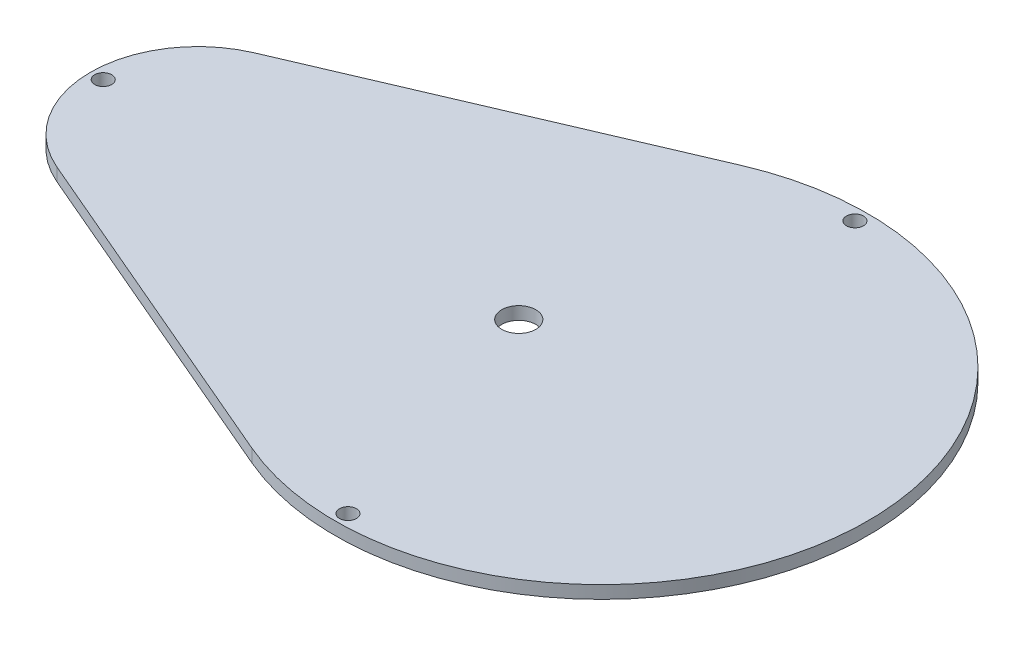
ISO-10303-21;
HEADER;
FILE_DESCRIPTION(('STEP AP214'),'2;1');
FILE_NAME('part.step','',(''),(''),'','','');
FILE_SCHEMA(('AUTOMOTIVE_DESIGN { 1 0 10303 214 1 1 1 1 }'));
ENDSEC;
DATA;
#1=APPLICATION_CONTEXT('core data for automotive mechanical design processes');
#2=APPLICATION_PROTOCOL_DEFINITION('international standard','automotive_design',2000,#1);
#3=PRODUCT_CONTEXT('',#1,'mechanical');
#4=PRODUCT('Part','Part','',(#3));
#5=PRODUCT_RELATED_PRODUCT_CATEGORY('part','',(#4));
#6=PRODUCT_DEFINITION_FORMATION('','',#4);
#7=PRODUCT_DEFINITION_CONTEXT('part definition',#1,'design');
#8=PRODUCT_DEFINITION('design','',#6,#7);
#9=PRODUCT_DEFINITION_SHAPE('','',#8);
#10=(LENGTH_UNIT() NAMED_UNIT(*) SI_UNIT(.MILLI.,.METRE.));
#11=(NAMED_UNIT(*) PLANE_ANGLE_UNIT() SI_UNIT($,.RADIAN.));
#12=(NAMED_UNIT(*) SI_UNIT($,.STERADIAN.) SOLID_ANGLE_UNIT());
#13=UNCERTAINTY_MEASURE_WITH_UNIT(LENGTH_MEASURE(1.E-05),#10,'distance_accuracy_value','');
#14=(GEOMETRIC_REPRESENTATION_CONTEXT(3) GLOBAL_UNCERTAINTY_ASSIGNED_CONTEXT((#13)) GLOBAL_UNIT_ASSIGNED_CONTEXT((#10,
#11,#12)) REPRESENTATION_CONTEXT('',''));
#15=CARTESIAN_POINT('',(0.,0.,0.));
#16=DIRECTION('',(0.,0.,1.));
#17=DIRECTION('',(1.,0.,0.));
#18=AXIS2_PLACEMENT_3D('',#15,#16,#17);
#19=CARTESIAN_POINT('',(0.,3.,0.));
#20=DIRECTION('',(0.,-1.,0.));
#21=DIRECTION('',(0.,0.,-1.));
#22=AXIS2_PLACEMENT_3D('',#19,#20,#21);
#23=CYLINDRICAL_SURFACE('',#22,62.5);
#24=CARTESIAN_POINT('',(0.,0.,0.));
#25=DIRECTION('',(0.,1.,0.));
#26=DIRECTION('',(0.,0.,1.));
#27=AXIS2_PLACEMENT_3D('',#24,#25,#26);
#28=CIRCLE('',#27,62.5);
#29=CARTESIAN_POINT('',(-24.5986851027459,0.,57.4556758833794));
#30=VERTEX_POINT('',#29);
#31=CARTESIAN_POINT('',(-24.5986851027459,0.,-57.4556758833794));
#32=VERTEX_POINT('',#31);
#33=EDGE_CURVE('E99',#30,#32,#28,.T.);
#34=ORIENTED_EDGE('',*,*,#33,.T.);
#35=DIRECTION('',(0.,-1.,0.));
#36=VECTOR('',#35,1.);
#37=CARTESIAN_POINT('',(-24.5986851027459,3.,-57.4556758833794));
#38=LINE('',#37,#36);
#39=CARTESIAN_POINT('',(-24.5986851027459,3.,-57.4556758833794));
#40=VERTEX_POINT('',#39);
#41=EDGE_CURVE('E11',#40,#32,#38,.T.);
#42=ORIENTED_EDGE('',*,*,#41,.F.);
#43=CARTESIAN_POINT('',(0.,3.,0.));
#44=DIRECTION('',(0.,1.,0.));
#45=DIRECTION('',(0.,0.,1.));
#46=AXIS2_PLACEMENT_3D('',#43,#44,#45);
#47=CIRCLE('',#46,62.5);
#48=CARTESIAN_POINT('',(-24.5986851027459,3.,57.4556758833794));
#49=VERTEX_POINT('',#48);
#50=EDGE_CURVE('E86',#49,#40,#47,.T.);
#51=ORIENTED_EDGE('',*,*,#50,.F.);
#52=DIRECTION('',(0.,-1.,0.));
#53=VECTOR('',#52,1.);
#54=CARTESIAN_POINT('',(-24.5986851027459,3.,57.4556758833794));
#55=LINE('',#54,#53);
#56=EDGE_CURVE('E95',#49,#30,#55,.T.);
#57=ORIENTED_EDGE('',*,*,#56,.T.);
#58=EDGE_LOOP('',(#34,#42,#51,#57));
#59=FACE_BOUND('',#58,.T.);
#60=ADVANCED_FACE('F33',(#59),#23,.T.);
#61=CARTESIAN_POINT('',(-104.654394699777,3.,-23.1811649533998));
#62=DIRECTION('',(0.393578961643935,0.,0.91929081413407));
#63=DIRECTION('',(0.919290814134071,0.,-0.393578961643935));
#64=AXIS2_PLACEMENT_3D('',#61,#62,#63);
#65=PLANE('',#64);
#66=DIRECTION('',(-0.919290814134071,0.,0.393578961643935));
#67=VECTOR('',#66,1.);
#68=CARTESIAN_POINT('',(-104.654394699777,0.,-23.1811649533998));
#69=LINE('',#68,#67);
#70=CARTESIAN_POINT('',(-104.654394699777,0.,-23.1811649533998));
#71=VERTEX_POINT('',#70);
#72=EDGE_CURVE('E90',#32,#71,#69,.T.);
#73=ORIENTED_EDGE('',*,*,#72,.T.);
#74=DIRECTION('',(0.,-1.,0.));
#75=VECTOR('',#74,1.);
#76=CARTESIAN_POINT('',(-104.654394699777,3.,-23.1811649533998));
#77=LINE('',#76,#75);
#78=CARTESIAN_POINT('',(-104.654394699777,3.,-23.1811649533998));
#79=VERTEX_POINT('',#78);
#80=EDGE_CURVE('E42',#79,#71,#77,.T.);
#81=ORIENTED_EDGE('',*,*,#80,.F.);
#82=DIRECTION('',(-0.919290814134071,0.,0.393578961643935));
#83=VECTOR('',#82,1.);
#84=CARTESIAN_POINT('',(-104.654394699777,3.,-23.1811649533998));
#85=LINE('',#84,#83);
#86=EDGE_CURVE('E81',#40,#79,#85,.T.);
#87=ORIENTED_EDGE('',*,*,#86,.F.);
#88=ORIENTED_EDGE('',*,*,#41,.T.);
#89=EDGE_LOOP('',(#73,#81,#87,#88));
#90=FACE_BOUND('',#89,.T.);
#91=ADVANCED_FACE('F89',(#90),#65,.F.);
#92=CARTESIAN_POINT('',(-94.729767267652,3.,0.));
#93=DIRECTION('',(0.,-1.,0.));
#94=DIRECTION('',(0.,0.,-1.));
#95=AXIS2_PLACEMENT_3D('',#92,#93,#94);
#96=CYLINDRICAL_SURFACE('',#95,25.2163565620259);
#97=CARTESIAN_POINT('',(-94.729767267652,0.,0.));
#98=DIRECTION('',(0.,1.,0.));
#99=DIRECTION('',(0.,0.,1.));
#100=AXIS2_PLACEMENT_3D('',#97,#98,#99);
#101=CIRCLE('',#100,25.2163565620259);
#102=CARTESIAN_POINT('',(-104.654394699777,0.,23.1811649533998));
#103=VERTEX_POINT('',#102);
#104=EDGE_CURVE('E68',#71,#103,#101,.T.);
#105=ORIENTED_EDGE('',*,*,#104,.T.);
#106=DIRECTION('',(0.,-1.,0.));
#107=VECTOR('',#106,1.);
#108=CARTESIAN_POINT('',(-104.654394699777,3.,23.1811649533998));
#109=LINE('',#108,#107);
#110=CARTESIAN_POINT('',(-104.654394699777,3.,23.1811649533998));
#111=VERTEX_POINT('',#110);
#112=EDGE_CURVE('E91',#111,#103,#109,.T.);
#113=ORIENTED_EDGE('',*,*,#112,.F.);
#114=CARTESIAN_POINT('',(-94.729767267652,3.,0.));
#115=DIRECTION('',(0.,1.,0.));
#116=DIRECTION('',(0.,0.,1.));
#117=AXIS2_PLACEMENT_3D('',#114,#115,#116);
#118=CIRCLE('',#117,25.2163565620259);
#119=EDGE_CURVE('E84',#79,#111,#118,.T.);
#120=ORIENTED_EDGE('',*,*,#119,.F.);
#121=ORIENTED_EDGE('',*,*,#80,.T.);
#122=EDGE_LOOP('',(#105,#113,#120,#121));
#123=FACE_BOUND('',#122,.T.);
#124=ADVANCED_FACE('F93',(#123),#96,.T.);
#125=CARTESIAN_POINT('',(-104.654394699777,3.,23.1811649533998));
#126=DIRECTION('',(0.393578961643935,0.,-0.919290814134071));
#127=DIRECTION('',(-0.919290814134071,0.,-0.393578961643935));
#128=AXIS2_PLACEMENT_3D('',#125,#126,#127);
#129=PLANE('',#128);
#130=DIRECTION('',(0.919290814134071,0.,0.393578961643935));
#131=VECTOR('',#130,1.);
#132=CARTESIAN_POINT('',(-104.654394699777,0.,23.1811649533998));
#133=LINE('',#132,#131);
#134=EDGE_CURVE('E74',#103,#30,#133,.T.);
#135=ORIENTED_EDGE('',*,*,#134,.T.);
#136=ORIENTED_EDGE('',*,*,#56,.F.);
#137=DIRECTION('',(0.919290814134071,0.,0.393578961643935));
#138=VECTOR('',#137,1.);
#139=CARTESIAN_POINT('',(-104.654394699777,3.,23.1811649533998));
#140=LINE('',#139,#138);
#141=EDGE_CURVE('E51',#111,#49,#140,.T.);
#142=ORIENTED_EDGE('',*,*,#141,.F.);
#143=ORIENTED_EDGE('',*,*,#112,.T.);
#144=EDGE_LOOP('',(#135,#136,#142,#143));
#145=FACE_BOUND('',#144,.T.);
#146=ADVANCED_FACE('F138',(#145),#129,.F.);
#147=CARTESIAN_POINT('',(0.,3.,0.));
#148=DIRECTION('',(0.,1.,0.));
#149=DIRECTION('',(0.,0.,1.));
#150=AXIS2_PLACEMENT_3D('',#147,#148,#149);
#151=PLANE('',#150);
#152=CARTESIAN_POINT('',(6.23241725801248E-13,3.,59.5));
#153=DIRECTION('',(0.,1.,0.));
#154=DIRECTION('',(0.,0.,1.));
#155=AXIS2_PLACEMENT_3D('',#152,#153,#154);
#156=CIRCLE('',#155,2.);
#157=CARTESIAN_POINT('',(6.23241725801248E-13,3.,61.5));
#158=VERTEX_POINT('',#157);
#159=EDGE_CURVE('E116',#158,#158,#156,.T.);
#160=ORIENTED_EDGE('',*,*,#159,.F.);
#161=EDGE_LOOP('',(#160));
#162=FACE_BOUND('',#161,.T.);
#163=CARTESIAN_POINT('',(0.,3.,-59.5));
#164=DIRECTION('',(0.,1.,0.));
#165=DIRECTION('',(0.,0.,1.));
#166=AXIS2_PLACEMENT_3D('',#163,#164,#165);
#167=CIRCLE('',#166,2.);
#168=CARTESIAN_POINT('',(0.,3.,-57.5));
#169=VERTEX_POINT('',#168);
#170=EDGE_CURVE('E121',#169,#169,#167,.T.);
#171=ORIENTED_EDGE('',*,*,#170,.F.);
#172=EDGE_LOOP('',(#171));
#173=FACE_BOUND('',#172,.T.);
#174=CARTESIAN_POINT('',(-116.946123829678,3.,0.));
#175=DIRECTION('',(0.,1.,0.));
#176=DIRECTION('',(0.,0.,1.));
#177=AXIS2_PLACEMENT_3D('',#174,#175,#176);
#178=CIRCLE('',#177,2.);
#179=CARTESIAN_POINT('',(-116.946123829678,3.,2.));
#180=VERTEX_POINT('',#179);
#181=EDGE_CURVE('E113',#180,#180,#178,.T.);
#182=ORIENTED_EDGE('',*,*,#181,.F.);
#183=EDGE_LOOP('',(#182));
#184=FACE_BOUND('',#183,.T.);
#185=CARTESIAN_POINT('',(-19.4028517241458,3.,0.));
#186=DIRECTION('',(0.,1.,0.));
#187=DIRECTION('',(0.,0.,1.));
#188=AXIS2_PLACEMENT_3D('',#185,#186,#187);
#189=CIRCLE('',#188,4.);
#190=CARTESIAN_POINT('',(-19.4028517241458,3.,3.99999999999999));
#191=VERTEX_POINT('',#190);
#192=EDGE_CURVE('E110',#191,#191,#189,.T.);
#193=ORIENTED_EDGE('',*,*,#192,.F.);
#194=EDGE_LOOP('',(#193));
#195=FACE_BOUND('',#194,.T.);
#196=ORIENTED_EDGE('',*,*,#50,.T.);
#197=ORIENTED_EDGE('',*,*,#86,.T.);
#198=ORIENTED_EDGE('',*,*,#119,.T.);
#199=ORIENTED_EDGE('',*,*,#141,.T.);
#200=EDGE_LOOP('',(#196,#197,#198,#199));
#201=FACE_BOUND('',#200,.T.);
#202=ADVANCED_FACE('F82',(#162,#173,#184,#195,#201),#151,.T.);
#203=CARTESIAN_POINT('',(0.,0.,0.));
#204=DIRECTION('',(0.,1.,0.));
#205=DIRECTION('',(0.,0.,1.));
#206=AXIS2_PLACEMENT_3D('',#203,#204,#205);
#207=PLANE('',#206);
#208=CARTESIAN_POINT('',(6.23241725801248E-13,0.,59.5));
#209=DIRECTION('',(0.,1.,0.));
#210=DIRECTION('',(0.,0.,1.));
#211=AXIS2_PLACEMENT_3D('',#208,#209,#210);
#212=CIRCLE('',#211,2.);
#213=CARTESIAN_POINT('',(6.23241725801248E-13,0.,61.5));
#214=VERTEX_POINT('',#213);
#215=EDGE_CURVE('E36',#214,#214,#212,.T.);
#216=ORIENTED_EDGE('',*,*,#215,.T.);
#217=EDGE_LOOP('',(#216));
#218=FACE_BOUND('',#217,.T.);
#219=CARTESIAN_POINT('',(0.,0.,-59.5));
#220=DIRECTION('',(0.,1.,0.));
#221=DIRECTION('',(0.,0.,1.));
#222=AXIS2_PLACEMENT_3D('',#219,#220,#221);
#223=CIRCLE('',#222,2.);
#224=CARTESIAN_POINT('',(0.,0.,-57.5));
#225=VERTEX_POINT('',#224);
#226=EDGE_CURVE('E114',#225,#225,#223,.T.);
#227=ORIENTED_EDGE('',*,*,#226,.T.);
#228=EDGE_LOOP('',(#227));
#229=FACE_BOUND('',#228,.T.);
#230=CARTESIAN_POINT('',(-116.946123829678,0.,0.));
#231=DIRECTION('',(0.,1.,0.));
#232=DIRECTION('',(0.,0.,1.));
#233=AXIS2_PLACEMENT_3D('',#230,#231,#232);
#234=CIRCLE('',#233,2.);
#235=CARTESIAN_POINT('',(-116.946123829678,0.,2.));
#236=VERTEX_POINT('',#235);
#237=EDGE_CURVE('E111',#236,#236,#234,.T.);
#238=ORIENTED_EDGE('',*,*,#237,.T.);
#239=EDGE_LOOP('',(#238));
#240=FACE_BOUND('',#239,.T.);
#241=CARTESIAN_POINT('',(-19.4028517241458,0.,0.));
#242=DIRECTION('',(0.,1.,0.));
#243=DIRECTION('',(0.,0.,1.));
#244=AXIS2_PLACEMENT_3D('',#241,#242,#243);
#245=CIRCLE('',#244,4.);
#246=CARTESIAN_POINT('',(-19.4028517241458,0.,3.99999999999999));
#247=VERTEX_POINT('',#246);
#248=EDGE_CURVE('E102',#247,#247,#245,.T.);
#249=ORIENTED_EDGE('',*,*,#248,.T.);
#250=EDGE_LOOP('',(#249));
#251=FACE_BOUND('',#250,.T.);
#252=ORIENTED_EDGE('',*,*,#33,.F.);
#253=ORIENTED_EDGE('',*,*,#134,.F.);
#254=ORIENTED_EDGE('',*,*,#104,.F.);
#255=ORIENTED_EDGE('',*,*,#72,.F.);
#256=EDGE_LOOP('',(#252,#253,#254,#255));
#257=FACE_BOUND('',#256,.T.);
#258=ADVANCED_FACE('F137',(#218,#229,#240,#251,#257),#207,.F.);
#259=CARTESIAN_POINT('',(-19.4028517241458,-4.99999999999999,0.));
#260=DIRECTION('',(0.,1.,0.));
#261=DIRECTION('',(0.,0.,1.));
#262=AXIS2_PLACEMENT_3D('',#259,#260,#261);
#263=CYLINDRICAL_SURFACE('',#262,4.);
#264=ORIENTED_EDGE('',*,*,#192,.T.);
#265=EDGE_LOOP('',(#264));
#266=FACE_BOUND('',#265,.T.);
#267=ORIENTED_EDGE('',*,*,#248,.F.);
#268=EDGE_LOOP('',(#267));
#269=FACE_BOUND('',#268,.T.);
#270=ADVANCED_FACE('F133',(#266,#269),#263,.F.);
#271=CARTESIAN_POINT('',(-116.946123829678,-7.,0.));
#272=DIRECTION('',(0.,1.,0.));
#273=DIRECTION('',(0.,0.,1.));
#274=AXIS2_PLACEMENT_3D('',#271,#272,#273);
#275=CYLINDRICAL_SURFACE('',#274,2.);
#276=ORIENTED_EDGE('',*,*,#181,.T.);
#277=EDGE_LOOP('',(#276));
#278=FACE_BOUND('',#277,.T.);
#279=ORIENTED_EDGE('',*,*,#237,.F.);
#280=EDGE_LOOP('',(#279));
#281=FACE_BOUND('',#280,.T.);
#282=ADVANCED_FACE('F176',(#278,#281),#275,.F.);
#283=CARTESIAN_POINT('',(0.,-7.,-59.5));
#284=DIRECTION('',(0.,1.,0.));
#285=DIRECTION('',(0.,0.,1.));
#286=AXIS2_PLACEMENT_3D('',#283,#284,#285);
#287=CYLINDRICAL_SURFACE('',#286,2.);
#288=ORIENTED_EDGE('',*,*,#170,.T.);
#289=EDGE_LOOP('',(#288));
#290=FACE_BOUND('',#289,.T.);
#291=ORIENTED_EDGE('',*,*,#226,.F.);
#292=EDGE_LOOP('',(#291));
#293=FACE_BOUND('',#292,.T.);
#294=ADVANCED_FACE('F194',(#290,#293),#287,.F.);
#295=CARTESIAN_POINT('',(6.23241725801248E-13,-7.,59.5));
#296=DIRECTION('',(0.,1.,0.));
#297=DIRECTION('',(0.,0.,1.));
#298=AXIS2_PLACEMENT_3D('',#295,#296,#297);
#299=CYLINDRICAL_SURFACE('',#298,2.);
#300=ORIENTED_EDGE('',*,*,#159,.T.);
#301=EDGE_LOOP('',(#300));
#302=FACE_BOUND('',#301,.T.);
#303=ORIENTED_EDGE('',*,*,#215,.F.);
#304=EDGE_LOOP('',(#303));
#305=FACE_BOUND('',#304,.T.);
#306=ADVANCED_FACE('F204',(#302,#305),#299,.F.);
#307=CLOSED_SHELL('',(#60,#91,#124,#146,#202,#258,#270,#282,#294,#306));
#308=MANIFOLD_SOLID_BREP('B2',#307);
#309=ADVANCED_BREP_SHAPE_REPRESENTATION('',(#18,#308),#14);
#310=SHAPE_DEFINITION_REPRESENTATION(#9,#309);
ENDSEC;
END-ISO-10303-21;
